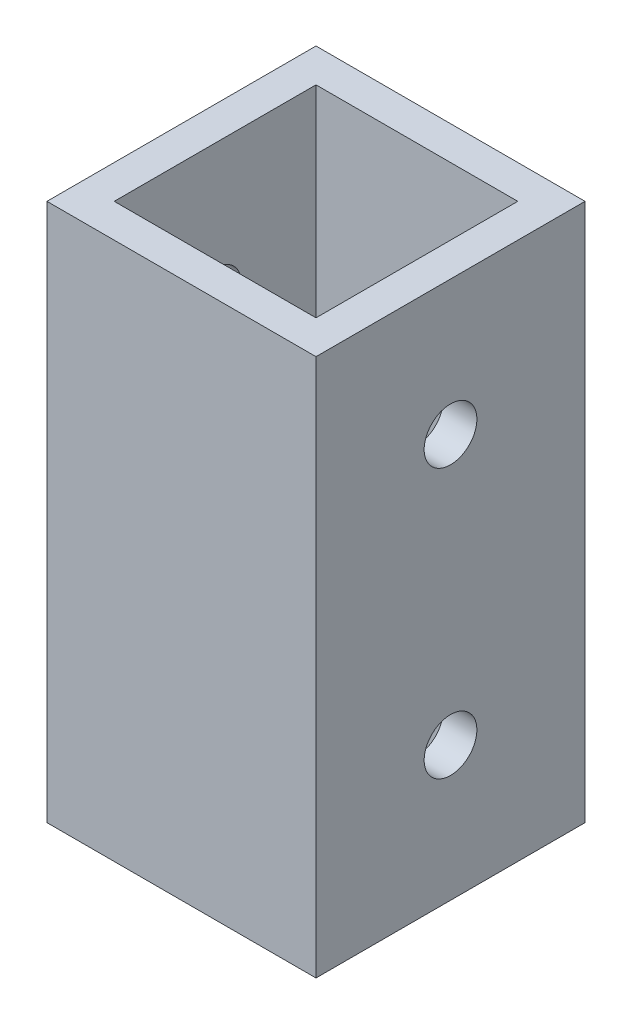
ISO-10303-21;
HEADER;
FILE_DESCRIPTION(('STEP AP214'),'2;1');
FILE_NAME('part.step','',(''),(''),'','','');
FILE_SCHEMA(('AUTOMOTIVE_DESIGN { 1 0 10303 214 1 1 1 1 }'));
ENDSEC;
DATA;
#1=APPLICATION_CONTEXT('core data for automotive mechanical design processes');
#2=APPLICATION_PROTOCOL_DEFINITION('international standard','automotive_design',2000,#1);
#3=PRODUCT_CONTEXT('',#1,'mechanical');
#4=PRODUCT('Part','Part','',(#3));
#5=PRODUCT_RELATED_PRODUCT_CATEGORY('part','',(#4));
#6=PRODUCT_DEFINITION_FORMATION('','',#4);
#7=PRODUCT_DEFINITION_CONTEXT('part definition',#1,'design');
#8=PRODUCT_DEFINITION('design','',#6,#7);
#9=PRODUCT_DEFINITION_SHAPE('','',#8);
#10=(LENGTH_UNIT() NAMED_UNIT(*) SI_UNIT(.MILLI.,.METRE.));
#11=(NAMED_UNIT(*) PLANE_ANGLE_UNIT() SI_UNIT($,.RADIAN.));
#12=(NAMED_UNIT(*) SI_UNIT($,.STERADIAN.) SOLID_ANGLE_UNIT());
#13=UNCERTAINTY_MEASURE_WITH_UNIT(LENGTH_MEASURE(1.E-05),#10,'distance_accuracy_value','');
#14=(GEOMETRIC_REPRESENTATION_CONTEXT(3) GLOBAL_UNCERTAINTY_ASSIGNED_CONTEXT((#13)) GLOBAL_UNIT_ASSIGNED_CONTEXT((#10,
#11,#12)) REPRESENTATION_CONTEXT('',''));
#15=CARTESIAN_POINT('',(0.,0.,0.));
#16=DIRECTION('',(0.,0.,1.));
#17=DIRECTION('',(1.,0.,0.));
#18=AXIS2_PLACEMENT_3D('',#15,#16,#17);
#19=CARTESIAN_POINT('',(0.,25.4,0.));
#20=DIRECTION('',(0.,1.,0.));
#21=DIRECTION('',(0.,0.,1.));
#22=AXIS2_PLACEMENT_3D('',#19,#20,#21);
#23=PLANE('',#22);
#24=DIRECTION('',(0.,0.,-1.));
#25=VECTOR('',#24,1.);
#26=CARTESIAN_POINT('',(12.7,25.4,12.7));
#27=LINE('',#26,#25);
#28=CARTESIAN_POINT('',(12.7,25.4,12.7));
#29=VERTEX_POINT('',#28);
#30=CARTESIAN_POINT('',(12.7,25.4,-12.7));
#31=VERTEX_POINT('',#30);
#32=EDGE_CURVE('E181',#29,#31,#27,.T.);
#33=ORIENTED_EDGE('',*,*,#32,.T.);
#34=DIRECTION('',(-1.,0.,0.));
#35=VECTOR('',#34,1.);
#36=CARTESIAN_POINT('',(-12.7,25.4,-12.7));
#37=LINE('',#36,#35);
#38=CARTESIAN_POINT('',(-12.7,25.4,-12.7));
#39=VERTEX_POINT('',#38);
#40=EDGE_CURVE('E185',#31,#39,#37,.T.);
#41=ORIENTED_EDGE('',*,*,#40,.T.);
#42=DIRECTION('',(0.,0.,1.));
#43=VECTOR('',#42,1.);
#44=CARTESIAN_POINT('',(-12.7,25.4,12.7));
#45=LINE('',#44,#43);
#46=CARTESIAN_POINT('',(-12.7,25.4,12.7));
#47=VERTEX_POINT('',#46);
#48=EDGE_CURVE('E189',#39,#47,#45,.T.);
#49=ORIENTED_EDGE('',*,*,#48,.T.);
#50=DIRECTION('',(1.,0.,0.));
#51=VECTOR('',#50,1.);
#52=CARTESIAN_POINT('',(-12.7,25.4,12.7));
#53=LINE('',#52,#51);
#54=EDGE_CURVE('E192',#47,#29,#53,.T.);
#55=ORIENTED_EDGE('',*,*,#54,.T.);
#56=EDGE_LOOP('',(#33,#41,#49,#55));
#57=FACE_BOUND('',#56,.T.);
#58=DIRECTION('',(-1.,0.,0.));
#59=VECTOR('',#58,1.);
#60=CARTESIAN_POINT('',(0.,25.4,-9.525));
#61=LINE('',#60,#59);
#62=CARTESIAN_POINT('',(9.525,25.4,-9.525));
#63=VERTEX_POINT('',#62);
#64=CARTESIAN_POINT('',(-9.525,25.4,-9.525));
#65=VERTEX_POINT('',#64);
#66=EDGE_CURVE('E140',#63,#65,#61,.T.);
#67=ORIENTED_EDGE('',*,*,#66,.F.);
#68=DIRECTION('',(0.,0.,-1.));
#69=VECTOR('',#68,1.);
#70=CARTESIAN_POINT('',(9.525,25.4,0.));
#71=LINE('',#70,#69);
#72=CARTESIAN_POINT('',(9.525,25.4,9.525));
#73=VERTEX_POINT('',#72);
#74=EDGE_CURVE('E131',#73,#63,#71,.T.);
#75=ORIENTED_EDGE('',*,*,#74,.F.);
#76=DIRECTION('',(1.,0.,0.));
#77=VECTOR('',#76,1.);
#78=CARTESIAN_POINT('',(0.,25.4,9.525));
#79=LINE('',#78,#77);
#80=CARTESIAN_POINT('',(-9.525,25.4,9.525));
#81=VERTEX_POINT('',#80);
#82=EDGE_CURVE('E157',#81,#73,#79,.T.);
#83=ORIENTED_EDGE('',*,*,#82,.F.);
#84=DIRECTION('',(0.,0.,1.));
#85=VECTOR('',#84,1.);
#86=CARTESIAN_POINT('',(-9.525,25.4,0.));
#87=LINE('',#86,#85);
#88=EDGE_CURVE('E153',#65,#81,#87,.T.);
#89=ORIENTED_EDGE('',*,*,#88,.F.);
#90=EDGE_LOOP('',(#67,#75,#83,#89));
#91=FACE_BOUND('',#90,.T.);
#92=ADVANCED_FACE('F63',(#57,#91),#23,.T.);
#93=CARTESIAN_POINT('',(0.,-25.4,0.));
#94=DIRECTION('',(0.,1.,0.));
#95=DIRECTION('',(0.,0.,1.));
#96=AXIS2_PLACEMENT_3D('',#93,#94,#95);
#97=PLANE('',#96);
#98=DIRECTION('',(0.,0.,-1.));
#99=VECTOR('',#98,1.);
#100=CARTESIAN_POINT('',(12.7,-25.4,12.7));
#101=LINE('',#100,#99);
#102=CARTESIAN_POINT('',(12.7,-25.4,12.7));
#103=VERTEX_POINT('',#102);
#104=CARTESIAN_POINT('',(12.7,-25.4,-12.7));
#105=VERTEX_POINT('',#104);
#106=EDGE_CURVE('E149',#103,#105,#101,.T.);
#107=ORIENTED_EDGE('',*,*,#106,.F.);
#108=DIRECTION('',(1.,0.,0.));
#109=VECTOR('',#108,1.);
#110=CARTESIAN_POINT('',(-12.7,-25.4,12.7));
#111=LINE('',#110,#109);
#112=CARTESIAN_POINT('',(-12.7,-25.4,12.7));
#113=VERTEX_POINT('',#112);
#114=EDGE_CURVE('E186',#113,#103,#111,.T.);
#115=ORIENTED_EDGE('',*,*,#114,.F.);
#116=DIRECTION('',(0.,0.,1.));
#117=VECTOR('',#116,1.);
#118=CARTESIAN_POINT('',(-12.7,-25.4,12.7));
#119=LINE('',#118,#117);
#120=CARTESIAN_POINT('',(-12.7,-25.4,-12.7));
#121=VERTEX_POINT('',#120);
#122=EDGE_CURVE('E202',#121,#113,#119,.T.);
#123=ORIENTED_EDGE('',*,*,#122,.F.);
#124=DIRECTION('',(-1.,0.,0.));
#125=VECTOR('',#124,1.);
#126=CARTESIAN_POINT('',(-12.7,-25.4,-12.7));
#127=LINE('',#126,#125);
#128=EDGE_CURVE('E199',#105,#121,#127,.T.);
#129=ORIENTED_EDGE('',*,*,#128,.F.);
#130=EDGE_LOOP('',(#107,#115,#123,#129));
#131=FACE_BOUND('',#130,.T.);
#132=DIRECTION('',(0.,0.,-1.));
#133=VECTOR('',#132,1.);
#134=CARTESIAN_POINT('',(9.525,-25.4,0.));
#135=LINE('',#134,#133);
#136=CARTESIAN_POINT('',(9.525,-25.4,9.525));
#137=VERTEX_POINT('',#136);
#138=CARTESIAN_POINT('',(9.525,-25.4,-9.525));
#139=VERTEX_POINT('',#138);
#140=EDGE_CURVE('E89',#137,#139,#135,.T.);
#141=ORIENTED_EDGE('',*,*,#140,.T.);
#142=DIRECTION('',(-1.,0.,0.));
#143=VECTOR('',#142,1.);
#144=CARTESIAN_POINT('',(0.,-25.4,-9.525));
#145=LINE('',#144,#143);
#146=CARTESIAN_POINT('',(-9.525,-25.4,-9.525));
#147=VERTEX_POINT('',#146);
#148=EDGE_CURVE('E147',#139,#147,#145,.T.);
#149=ORIENTED_EDGE('',*,*,#148,.T.);
#150=DIRECTION('',(0.,0.,1.));
#151=VECTOR('',#150,1.);
#152=CARTESIAN_POINT('',(-9.525,-25.4,0.));
#153=LINE('',#152,#151);
#154=CARTESIAN_POINT('',(-9.525,-25.4,9.525));
#155=VERTEX_POINT('',#154);
#156=EDGE_CURVE('E168',#147,#155,#153,.T.);
#157=ORIENTED_EDGE('',*,*,#156,.T.);
#158=DIRECTION('',(1.,0.,0.));
#159=VECTOR('',#158,1.);
#160=CARTESIAN_POINT('',(0.,-25.4,9.525));
#161=LINE('',#160,#159);
#162=EDGE_CURVE('E141',#155,#137,#161,.T.);
#163=ORIENTED_EDGE('',*,*,#162,.T.);
#164=EDGE_LOOP('',(#141,#149,#157,#163));
#165=FACE_BOUND('',#164,.T.);
#166=ADVANCED_FACE('F262',(#131,#165),#97,.F.);
#167=CARTESIAN_POINT('',(12.7,25.4,12.7));
#168=DIRECTION('',(-1.,0.,0.));
#169=DIRECTION('',(0.,0.,1.));
#170=AXIS2_PLACEMENT_3D('',#167,#168,#169);
#171=PLANE('',#170);
#172=CARTESIAN_POINT('',(12.7,12.7,0.));
#173=DIRECTION('',(1.,0.,0.));
#174=DIRECTION('',(0.,0.,-1.));
#175=AXIS2_PLACEMENT_3D('',#172,#173,#174);
#176=CIRCLE('',#175,2.4892);
#177=CARTESIAN_POINT('',(12.7,12.7,-2.4892));
#178=VERTEX_POINT('',#177);
#179=EDGE_CURVE('E228',#178,#178,#176,.T.);
#180=ORIENTED_EDGE('',*,*,#179,.F.);
#181=EDGE_LOOP('',(#180));
#182=FACE_BOUND('',#181,.T.);
#183=CARTESIAN_POINT('',(12.7,-12.7,0.));
#184=DIRECTION('',(1.,0.,0.));
#185=DIRECTION('',(0.,0.,-1.));
#186=AXIS2_PLACEMENT_3D('',#183,#184,#185);
#187=CIRCLE('',#186,2.4892);
#188=CARTESIAN_POINT('',(12.7,-12.7,-2.48920000000001));
#189=VERTEX_POINT('',#188);
#190=EDGE_CURVE('E240',#189,#189,#187,.T.);
#191=ORIENTED_EDGE('',*,*,#190,.F.);
#192=EDGE_LOOP('',(#191));
#193=FACE_BOUND('',#192,.T.);
#194=ORIENTED_EDGE('',*,*,#106,.T.);
#195=DIRECTION('',(0.,-1.,0.));
#196=VECTOR('',#195,1.);
#197=CARTESIAN_POINT('',(12.7,25.4,-12.7));
#198=LINE('',#197,#196);
#199=EDGE_CURVE('E12',#31,#105,#198,.T.);
#200=ORIENTED_EDGE('',*,*,#199,.F.);
#201=ORIENTED_EDGE('',*,*,#32,.F.);
#202=DIRECTION('',(0.,-1.,0.));
#203=VECTOR('',#202,1.);
#204=CARTESIAN_POINT('',(12.7,25.4,12.7));
#205=LINE('',#204,#203);
#206=EDGE_CURVE('E195',#29,#103,#205,.T.);
#207=ORIENTED_EDGE('',*,*,#206,.T.);
#208=EDGE_LOOP('',(#194,#200,#201,#207));
#209=FACE_BOUND('',#208,.T.);
#210=ADVANCED_FACE('F65',(#182,#193,#209),#171,.F.);
#211=CARTESIAN_POINT('',(-12.7,25.4,-12.7));
#212=DIRECTION('',(0.,0.,1.));
#213=DIRECTION('',(1.,0.,0.));
#214=AXIS2_PLACEMENT_3D('',#211,#212,#213);
#215=PLANE('',#214);
#216=ORIENTED_EDGE('',*,*,#128,.T.);
#217=DIRECTION('',(0.,-1.,0.));
#218=VECTOR('',#217,1.);
#219=CARTESIAN_POINT('',(-12.7,25.4,-12.7));
#220=LINE('',#219,#218);
#221=EDGE_CURVE('E73',#39,#121,#220,.T.);
#222=ORIENTED_EDGE('',*,*,#221,.F.);
#223=ORIENTED_EDGE('',*,*,#40,.F.);
#224=ORIENTED_EDGE('',*,*,#199,.T.);
#225=EDGE_LOOP('',(#216,#222,#223,#224));
#226=FACE_BOUND('',#225,.T.);
#227=ADVANCED_FACE('F288',(#226),#215,.F.);
#228=CARTESIAN_POINT('',(-12.7,25.4,12.7));
#229=DIRECTION('',(1.,0.,0.));
#230=DIRECTION('',(0.,0.,-1.));
#231=AXIS2_PLACEMENT_3D('',#228,#229,#230);
#232=PLANE('',#231);
#233=CARTESIAN_POINT('',(-12.7,12.7,0.));
#234=DIRECTION('',(1.,0.,0.));
#235=DIRECTION('',(0.,0.,-1.));
#236=AXIS2_PLACEMENT_3D('',#233,#234,#235);
#237=CIRCLE('',#236,2.4892);
#238=CARTESIAN_POINT('',(-12.7,12.7,-2.4892));
#239=VERTEX_POINT('',#238);
#240=EDGE_CURVE('E220',#239,#239,#237,.T.);
#241=ORIENTED_EDGE('',*,*,#240,.T.);
#242=EDGE_LOOP('',(#241));
#243=FACE_BOUND('',#242,.T.);
#244=CARTESIAN_POINT('',(-12.7,-12.7,0.));
#245=DIRECTION('',(1.,0.,0.));
#246=DIRECTION('',(0.,0.,-1.));
#247=AXIS2_PLACEMENT_3D('',#244,#245,#246);
#248=CIRCLE('',#247,2.4892);
#249=CARTESIAN_POINT('',(-12.7,-12.7,-2.48920000000001));
#250=VERTEX_POINT('',#249);
#251=EDGE_CURVE('E234',#250,#250,#248,.T.);
#252=ORIENTED_EDGE('',*,*,#251,.T.);
#253=EDGE_LOOP('',(#252));
#254=FACE_BOUND('',#253,.T.);
#255=ORIENTED_EDGE('',*,*,#122,.T.);
#256=DIRECTION('',(0.,-1.,0.));
#257=VECTOR('',#256,1.);
#258=CARTESIAN_POINT('',(-12.7,25.4,12.7));
#259=LINE('',#258,#257);
#260=EDGE_CURVE('E210',#47,#113,#259,.T.);
#261=ORIENTED_EDGE('',*,*,#260,.F.);
#262=ORIENTED_EDGE('',*,*,#48,.F.);
#263=ORIENTED_EDGE('',*,*,#221,.T.);
#264=EDGE_LOOP('',(#255,#261,#262,#263));
#265=FACE_BOUND('',#264,.T.);
#266=ADVANCED_FACE('F285',(#243,#254,#265),#232,.F.);
#267=CARTESIAN_POINT('',(-12.7,25.4,12.7));
#268=DIRECTION('',(0.,0.,-1.));
#269=DIRECTION('',(-1.,0.,0.));
#270=AXIS2_PLACEMENT_3D('',#267,#268,#269);
#271=PLANE('',#270);
#272=ORIENTED_EDGE('',*,*,#114,.T.);
#273=ORIENTED_EDGE('',*,*,#206,.F.);
#274=ORIENTED_EDGE('',*,*,#54,.F.);
#275=ORIENTED_EDGE('',*,*,#260,.T.);
#276=EDGE_LOOP('',(#272,#273,#274,#275));
#277=FACE_BOUND('',#276,.T.);
#278=ADVANCED_FACE('F282',(#277),#271,.F.);
#279=CARTESIAN_POINT('',(9.525,25.4,0.));
#280=DIRECTION('',(-1.,0.,0.));
#281=DIRECTION('',(0.,0.,1.));
#282=AXIS2_PLACEMENT_3D('',#279,#280,#281);
#283=PLANE('',#282);
#284=CARTESIAN_POINT('',(9.525,12.7,0.));
#285=DIRECTION('',(-1.,0.,0.));
#286=DIRECTION('',(0.,0.,1.));
#287=AXIS2_PLACEMENT_3D('',#284,#285,#286);
#288=CIRCLE('',#287,2.4892);
#289=CARTESIAN_POINT('',(9.525,12.7,2.4892));
#290=VERTEX_POINT('',#289);
#291=EDGE_CURVE('E165',#290,#290,#288,.T.);
#292=ORIENTED_EDGE('',*,*,#291,.F.);
#293=EDGE_LOOP('',(#292));
#294=FACE_BOUND('',#293,.T.);
#295=CARTESIAN_POINT('',(9.525,-12.7,0.));
#296=DIRECTION('',(-1.,0.,0.));
#297=DIRECTION('',(0.,0.,1.));
#298=AXIS2_PLACEMENT_3D('',#295,#296,#297);
#299=CIRCLE('',#298,2.4892);
#300=CARTESIAN_POINT('',(9.525,-12.7,2.48919999999999));
#301=VERTEX_POINT('',#300);
#302=EDGE_CURVE('E219',#301,#301,#299,.T.);
#303=ORIENTED_EDGE('',*,*,#302,.F.);
#304=EDGE_LOOP('',(#303));
#305=FACE_BOUND('',#304,.T.);
#306=ORIENTED_EDGE('',*,*,#140,.F.);
#307=DIRECTION('',(0.,-1.,0.));
#308=VECTOR('',#307,1.);
#309=CARTESIAN_POINT('',(9.525,25.4,9.525));
#310=LINE('',#309,#308);
#311=EDGE_CURVE('E135',#73,#137,#310,.T.);
#312=ORIENTED_EDGE('',*,*,#311,.F.);
#313=ORIENTED_EDGE('',*,*,#74,.T.);
#314=DIRECTION('',(0.,-1.,0.));
#315=VECTOR('',#314,1.);
#316=CARTESIAN_POINT('',(9.525,25.4,-9.525));
#317=LINE('',#316,#315);
#318=EDGE_CURVE('E134',#63,#139,#317,.T.);
#319=ORIENTED_EDGE('',*,*,#318,.T.);
#320=EDGE_LOOP('',(#306,#312,#313,#319));
#321=FACE_BOUND('',#320,.T.);
#322=ADVANCED_FACE('F133',(#294,#305,#321),#283,.T.);
#323=CARTESIAN_POINT('',(0.,25.4,-9.525));
#324=DIRECTION('',(0.,0.,1.));
#325=DIRECTION('',(1.,0.,0.));
#326=AXIS2_PLACEMENT_3D('',#323,#324,#325);
#327=PLANE('',#326);
#328=ORIENTED_EDGE('',*,*,#148,.F.);
#329=ORIENTED_EDGE('',*,*,#318,.F.);
#330=ORIENTED_EDGE('',*,*,#66,.T.);
#331=DIRECTION('',(0.,-1.,0.));
#332=VECTOR('',#331,1.);
#333=CARTESIAN_POINT('',(-9.525,25.4,-9.525));
#334=LINE('',#333,#332);
#335=EDGE_CURVE('E150',#65,#147,#334,.T.);
#336=ORIENTED_EDGE('',*,*,#335,.T.);
#337=EDGE_LOOP('',(#328,#329,#330,#336));
#338=FACE_BOUND('',#337,.T.);
#339=ADVANCED_FACE('F144',(#338),#327,.T.);
#340=CARTESIAN_POINT('',(-9.525,25.4,0.));
#341=DIRECTION('',(1.,0.,0.));
#342=DIRECTION('',(0.,0.,-1.));
#343=AXIS2_PLACEMENT_3D('',#340,#341,#342);
#344=PLANE('',#343);
#345=CARTESIAN_POINT('',(-9.525,12.7,0.));
#346=DIRECTION('',(1.,0.,0.));
#347=DIRECTION('',(0.,0.,-1.));
#348=AXIS2_PLACEMENT_3D('',#345,#346,#347);
#349=CIRCLE('',#348,2.4892);
#350=CARTESIAN_POINT('',(-9.525,12.7,-2.4892));
#351=VERTEX_POINT('',#350);
#352=EDGE_CURVE('E67',#351,#351,#349,.T.);
#353=ORIENTED_EDGE('',*,*,#352,.F.);
#354=EDGE_LOOP('',(#353));
#355=FACE_BOUND('',#354,.T.);
#356=CARTESIAN_POINT('',(-9.525,-12.7,0.));
#357=DIRECTION('',(1.,0.,0.));
#358=DIRECTION('',(0.,0.,-1.));
#359=AXIS2_PLACEMENT_3D('',#356,#357,#358);
#360=CIRCLE('',#359,2.4892);
#361=CARTESIAN_POINT('',(-9.525,-12.7,-2.48920000000001));
#362=VERTEX_POINT('',#361);
#363=EDGE_CURVE('E216',#362,#362,#360,.T.);
#364=ORIENTED_EDGE('',*,*,#363,.F.);
#365=EDGE_LOOP('',(#364));
#366=FACE_BOUND('',#365,.T.);
#367=ORIENTED_EDGE('',*,*,#156,.F.);
#368=ORIENTED_EDGE('',*,*,#335,.F.);
#369=ORIENTED_EDGE('',*,*,#88,.T.);
#370=DIRECTION('',(0.,-1.,0.));
#371=VECTOR('',#370,1.);
#372=CARTESIAN_POINT('',(-9.525,25.4,9.525));
#373=LINE('',#372,#371);
#374=EDGE_CURVE('E81',#81,#155,#373,.T.);
#375=ORIENTED_EDGE('',*,*,#374,.T.);
#376=EDGE_LOOP('',(#367,#368,#369,#375));
#377=FACE_BOUND('',#376,.T.);
#378=ADVANCED_FACE('F254',(#355,#366,#377),#344,.T.);
#379=CARTESIAN_POINT('',(0.,25.4,9.525));
#380=DIRECTION('',(0.,0.,-1.));
#381=DIRECTION('',(-1.,0.,0.));
#382=AXIS2_PLACEMENT_3D('',#379,#380,#381);
#383=PLANE('',#382);
#384=ORIENTED_EDGE('',*,*,#162,.F.);
#385=ORIENTED_EDGE('',*,*,#374,.F.);
#386=ORIENTED_EDGE('',*,*,#82,.T.);
#387=ORIENTED_EDGE('',*,*,#311,.T.);
#388=EDGE_LOOP('',(#384,#385,#386,#387));
#389=FACE_BOUND('',#388,.T.);
#390=ADVANCED_FACE('F257',(#389),#383,.T.);
#391=CARTESIAN_POINT('',(-12.7,-12.7,0.));
#392=DIRECTION('',(1.,0.,0.));
#393=DIRECTION('',(0.,0.,-1.));
#394=AXIS2_PLACEMENT_3D('',#391,#392,#393);
#395=CYLINDRICAL_SURFACE('',#394,2.4892);
#396=ORIENTED_EDGE('',*,*,#363,.T.);
#397=EDGE_LOOP('',(#396));
#398=FACE_BOUND('',#397,.T.);
#399=ORIENTED_EDGE('',*,*,#251,.F.);
#400=EDGE_LOOP('',(#399));
#401=FACE_BOUND('',#400,.T.);
#402=ADVANCED_FACE('F264',(#398,#401),#395,.F.);
#403=CARTESIAN_POINT('',(-12.7,12.7,0.));
#404=DIRECTION('',(1.,0.,0.));
#405=DIRECTION('',(0.,0.,-1.));
#406=AXIS2_PLACEMENT_3D('',#403,#404,#405);
#407=CYLINDRICAL_SURFACE('',#406,2.4892);
#408=ORIENTED_EDGE('',*,*,#352,.T.);
#409=EDGE_LOOP('',(#408));
#410=FACE_BOUND('',#409,.T.);
#411=ORIENTED_EDGE('',*,*,#240,.F.);
#412=EDGE_LOOP('',(#411));
#413=FACE_BOUND('',#412,.T.);
#414=ADVANCED_FACE('F251',(#410,#413),#407,.F.);
#415=ORIENTED_EDGE('',*,*,#302,.T.);
#416=EDGE_LOOP('',(#415));
#417=FACE_BOUND('',#416,.T.);
#418=ORIENTED_EDGE('',*,*,#190,.T.);
#419=EDGE_LOOP('',(#418));
#420=FACE_BOUND('',#419,.T.);
#421=ADVANCED_FACE('F270',(#417,#420),#395,.F.);
#422=ORIENTED_EDGE('',*,*,#291,.T.);
#423=EDGE_LOOP('',(#422));
#424=FACE_BOUND('',#423,.T.);
#425=ORIENTED_EDGE('',*,*,#179,.T.);
#426=EDGE_LOOP('',(#425));
#427=FACE_BOUND('',#426,.T.);
#428=ADVANCED_FACE('F314',(#424,#427),#407,.F.);
#429=CLOSED_SHELL('',(#92,#166,#210,#227,#266,#278,#322,#339,#378,#390,#402,#414,#421,#428));
#430=MANIFOLD_SOLID_BREP('B2',#429);
#431=ADVANCED_BREP_SHAPE_REPRESENTATION('',(#18,#430),#14);
#432=SHAPE_DEFINITION_REPRESENTATION(#9,#431);
ENDSEC;
END-ISO-10303-21;
